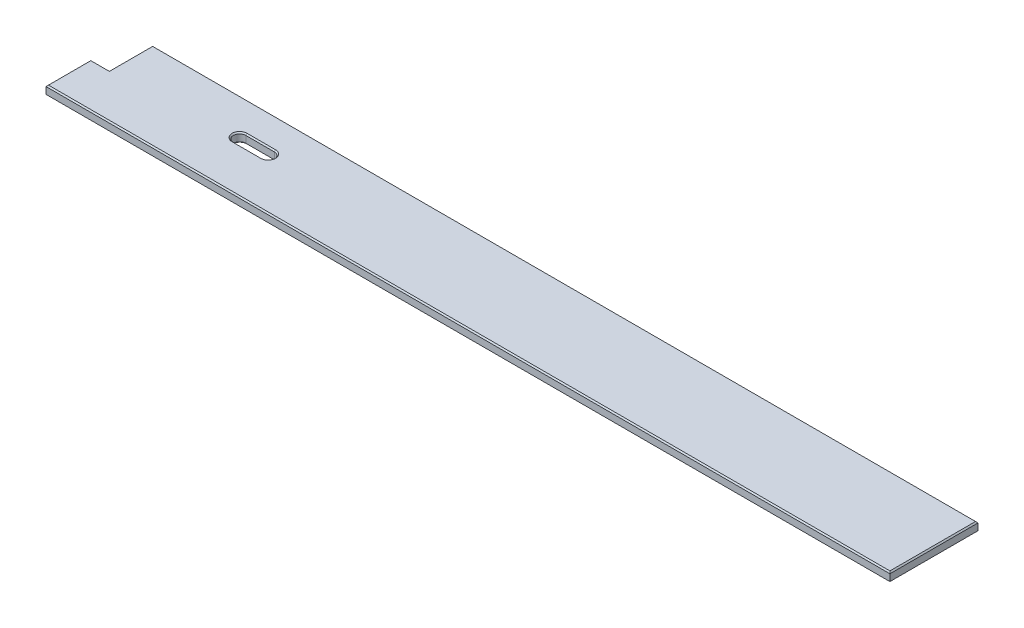
ISO-10303-21;
HEADER;
FILE_DESCRIPTION(('STEP AP214'),'2;1');
FILE_NAME('part.step','',(''),(''),'','','');
FILE_SCHEMA(('AUTOMOTIVE_DESIGN { 1 0 10303 214 1 1 1 1 }'));
ENDSEC;
DATA;
#1=APPLICATION_CONTEXT('core data for automotive mechanical design processes');
#2=APPLICATION_PROTOCOL_DEFINITION('international standard','automotive_design',2000,#1);
#3=PRODUCT_CONTEXT('',#1,'mechanical');
#4=PRODUCT('Part','Part','',(#3));
#5=PRODUCT_RELATED_PRODUCT_CATEGORY('part','',(#4));
#6=PRODUCT_DEFINITION_FORMATION('','',#4);
#7=PRODUCT_DEFINITION_CONTEXT('part definition',#1,'design');
#8=PRODUCT_DEFINITION('design','',#6,#7);
#9=PRODUCT_DEFINITION_SHAPE('','',#8);
#10=(LENGTH_UNIT() NAMED_UNIT(*) SI_UNIT(.MILLI.,.METRE.));
#11=(NAMED_UNIT(*) PLANE_ANGLE_UNIT() SI_UNIT($,.RADIAN.));
#12=(NAMED_UNIT(*) SI_UNIT($,.STERADIAN.) SOLID_ANGLE_UNIT());
#13=UNCERTAINTY_MEASURE_WITH_UNIT(LENGTH_MEASURE(1.E-05),#10,'distance_accuracy_value','');
#14=(GEOMETRIC_REPRESENTATION_CONTEXT(3) GLOBAL_UNCERTAINTY_ASSIGNED_CONTEXT((#13)) GLOBAL_UNIT_ASSIGNED_CONTEXT((#10,
#11,#12)) REPRESENTATION_CONTEXT('',''));
#15=CARTESIAN_POINT('',(0.,0.,0.));
#16=DIRECTION('',(0.,0.,1.));
#17=DIRECTION('',(1.,0.,0.));
#18=AXIS2_PLACEMENT_3D('',#15,#16,#17);
#19=CARTESIAN_POINT('',(0.,19.05,0.));
#20=DIRECTION('',(0.,-1.,0.));
#21=DIRECTION('',(0.,0.,-1.));
#22=AXIS2_PLACEMENT_3D('',#19,#20,#21);
#23=PLANE('',#22);
#24=CARTESIAN_POINT('',(254.,19.05,-105.55605));
#25=DIRECTION('',(0.,-1.,0.));
#26=DIRECTION('',(0.,0.,-1.));
#27=AXIS2_PLACEMENT_3D('',#24,#25,#26);
#28=CIRCLE('',#27,15.240000000001);
#29=CARTESIAN_POINT('',(254.,19.05,-90.3160499999989));
#30=VERTEX_POINT('',#29);
#31=CARTESIAN_POINT('',(254.,19.05,-120.796050000001));
#32=VERTEX_POINT('',#31);
#33=EDGE_CURVE('E243',#30,#32,#28,.T.);
#34=ORIENTED_EDGE('',*,*,#33,.T.);
#35=DIRECTION('',(1.,0.,0.));
#36=VECTOR('',#35,1.);
#37=CARTESIAN_POINT('',(312.7502,19.05,-120.796050000001));
#38=LINE('',#37,#36);
#39=CARTESIAN_POINT('',(312.7502,19.05,-120.796050000001));
#40=VERTEX_POINT('',#39);
#41=EDGE_CURVE('E245',#32,#40,#38,.T.);
#42=ORIENTED_EDGE('',*,*,#41,.T.);
#43=CARTESIAN_POINT('',(312.7502,19.05,-105.55605));
#44=DIRECTION('',(0.,-1.,0.));
#45=DIRECTION('',(0.,0.,-1.));
#46=AXIS2_PLACEMENT_3D('',#43,#44,#45);
#47=CIRCLE('',#46,15.240000000001);
#48=CARTESIAN_POINT('',(312.7502,19.05,-90.3160499999989));
#49=VERTEX_POINT('',#48);
#50=EDGE_CURVE('E211',#40,#49,#47,.T.);
#51=ORIENTED_EDGE('',*,*,#50,.T.);
#52=DIRECTION('',(-1.,0.,0.));
#53=VECTOR('',#52,1.);
#54=CARTESIAN_POINT('',(254.,19.05,-90.3160499999989));
#55=LINE('',#54,#53);
#56=EDGE_CURVE('E241',#49,#30,#55,.T.);
#57=ORIENTED_EDGE('',*,*,#56,.T.);
#58=EDGE_LOOP('',(#34,#42,#51,#57));
#59=FACE_BOUND('',#58,.T.);
#60=DIRECTION('',(0.,0.,-1.));
#61=VECTOR('',#60,1.);
#62=CARTESIAN_POINT('',(1692.91,19.05,0.));
#63=LINE('',#62,#61);
#64=CARTESIAN_POINT('',(1692.91,19.05,-2.53999999999999));
#65=VERTEX_POINT('',#64);
#66=CARTESIAN_POINT('',(1692.91,19.05,-178.435));
#67=VERTEX_POINT('',#66);
#68=EDGE_CURVE('E235',#65,#67,#63,.T.);
#69=ORIENTED_EDGE('',*,*,#68,.T.);
#70=DIRECTION('',(-1.,0.,0.));
#71=VECTOR('',#70,1.);
#72=CARTESIAN_POINT('',(0.,19.05,-178.435));
#73=LINE('',#72,#71);
#74=CARTESIAN_POINT('',(2.53999999999999,19.05,-178.435));
#75=VERTEX_POINT('',#74);
#76=EDGE_CURVE('E237',#67,#75,#73,.T.);
#77=ORIENTED_EDGE('',*,*,#76,.T.);
#78=DIRECTION('',(0.,0.,1.));
#79=VECTOR('',#78,1.);
#80=CARTESIAN_POINT('',(2.53999999999999,19.05,0.));
#81=LINE('',#80,#79);
#82=CARTESIAN_POINT('',(2.53999999999999,19.05,-89.535));
#83=VERTEX_POINT('',#82);
#84=EDGE_CURVE('E221',#75,#83,#81,.T.);
#85=ORIENTED_EDGE('',*,*,#84,.T.);
#86=DIRECTION('',(-1.,0.,0.));
#87=VECTOR('',#86,1.);
#88=CARTESIAN_POINT('',(-38.1,19.05,-89.535));
#89=LINE('',#88,#87);
#90=CARTESIAN_POINT('',(-35.56,19.05,-89.535));
#91=VERTEX_POINT('',#90);
#92=EDGE_CURVE('E224',#83,#91,#89,.T.);
#93=ORIENTED_EDGE('',*,*,#92,.T.);
#94=DIRECTION('',(0.,0.,1.));
#95=VECTOR('',#94,1.);
#96=CARTESIAN_POINT('',(-35.56,19.05,0.));
#97=LINE('',#96,#95);
#98=CARTESIAN_POINT('',(-35.56,19.05,-2.53999999999999));
#99=VERTEX_POINT('',#98);
#100=EDGE_CURVE('E231',#91,#99,#97,.T.);
#101=ORIENTED_EDGE('',*,*,#100,.T.);
#102=DIRECTION('',(1.,0.,0.));
#103=VECTOR('',#102,1.);
#104=CARTESIAN_POINT('',(0.,19.05,-2.53999999999999));
#105=LINE('',#104,#103);
#106=EDGE_CURVE('E233',#99,#65,#105,.T.);
#107=ORIENTED_EDGE('',*,*,#106,.T.);
#108=EDGE_LOOP('',(#69,#77,#85,#93,#101,#107));
#109=FACE_BOUND('',#108,.T.);
#110=ADVANCED_FACE('F40',(#59,#109),#23,.F.);
#111=CARTESIAN_POINT('',(0.,0.,0.));
#112=DIRECTION('',(0.,-1.,0.));
#113=DIRECTION('',(0.,0.,-1.));
#114=AXIS2_PLACEMENT_3D('',#111,#112,#113);
#115=PLANE('',#114);
#116=DIRECTION('',(-1.,0.,0.));
#117=VECTOR('',#116,1.);
#118=CARTESIAN_POINT('',(0.,0.,-120.79605));
#119=LINE('',#118,#117);
#120=CARTESIAN_POINT('',(312.7502,0.,-120.79605));
#121=VERTEX_POINT('',#120);
#122=CARTESIAN_POINT('',(254.,0.,-120.79605));
#123=VERTEX_POINT('',#122);
#124=EDGE_CURVE('E305',#121,#123,#119,.T.);
#125=ORIENTED_EDGE('',*,*,#124,.T.);
#126=CARTESIAN_POINT('',(254.,0.,-105.55605));
#127=DIRECTION('',(0.,-1.,0.));
#128=DIRECTION('',(0.,0.,-1.));
#129=AXIS2_PLACEMENT_3D('',#126,#127,#128);
#130=CIRCLE('',#129,15.24);
#131=CARTESIAN_POINT('',(254.,0.,-90.31605));
#132=VERTEX_POINT('',#131);
#133=EDGE_CURVE('E307',#123,#132,#130,.F.);
#134=ORIENTED_EDGE('',*,*,#133,.T.);
#135=DIRECTION('',(1.,0.,0.));
#136=VECTOR('',#135,1.);
#137=CARTESIAN_POINT('',(0.,0.,-90.31605));
#138=LINE('',#137,#136);
#139=CARTESIAN_POINT('',(312.7502,0.,-90.31605));
#140=VERTEX_POINT('',#139);
#141=EDGE_CURVE('E301',#132,#140,#138,.T.);
#142=ORIENTED_EDGE('',*,*,#141,.T.);
#143=CARTESIAN_POINT('',(312.7502,0.,-105.55605));
#144=DIRECTION('',(0.,-1.,0.));
#145=DIRECTION('',(0.,0.,-1.));
#146=AXIS2_PLACEMENT_3D('',#143,#144,#145);
#147=CIRCLE('',#146,15.24);
#148=EDGE_CURVE('E303',#140,#121,#147,.F.);
#149=ORIENTED_EDGE('',*,*,#148,.T.);
#150=EDGE_LOOP('',(#125,#134,#142,#149));
#151=FACE_BOUND('',#150,.T.);
#152=DIRECTION('',(0.,0.,-1.));
#153=VECTOR('',#152,1.);
#154=CARTESIAN_POINT('',(-35.56,0.,0.));
#155=LINE('',#154,#153);
#156=CARTESIAN_POINT('',(-35.56,0.,-2.53999999999999));
#157=VERTEX_POINT('',#156);
#158=CARTESIAN_POINT('',(-35.56,0.,-89.535));
#159=VERTEX_POINT('',#158);
#160=EDGE_CURVE('E296',#157,#159,#155,.T.);
#161=ORIENTED_EDGE('',*,*,#160,.T.);
#162=DIRECTION('',(1.,0.,0.));
#163=VECTOR('',#162,1.);
#164=CARTESIAN_POINT('',(0.,0.,-89.535));
#165=LINE('',#164,#163);
#166=CARTESIAN_POINT('',(2.53999999999999,0.,-89.535));
#167=VERTEX_POINT('',#166);
#168=EDGE_CURVE('E298',#159,#167,#165,.T.);
#169=ORIENTED_EDGE('',*,*,#168,.T.);
#170=DIRECTION('',(0.,0.,-1.));
#171=VECTOR('',#170,1.);
#172=CARTESIAN_POINT('',(2.53999999999999,0.,-180.975));
#173=LINE('',#172,#171);
#174=CARTESIAN_POINT('',(2.53999999999999,0.,-178.435));
#175=VERTEX_POINT('',#174);
#176=EDGE_CURVE('E265',#167,#175,#173,.T.);
#177=ORIENTED_EDGE('',*,*,#176,.T.);
#178=DIRECTION('',(1.,0.,0.));
#179=VECTOR('',#178,1.);
#180=CARTESIAN_POINT('',(1695.45,0.,-178.435));
#181=LINE('',#180,#179);
#182=CARTESIAN_POINT('',(1692.91,0.,-178.435));
#183=VERTEX_POINT('',#182);
#184=EDGE_CURVE('E290',#175,#183,#181,.T.);
#185=ORIENTED_EDGE('',*,*,#184,.T.);
#186=DIRECTION('',(0.,0.,1.));
#187=VECTOR('',#186,1.);
#188=CARTESIAN_POINT('',(1692.91,0.,0.));
#189=LINE('',#188,#187);
#190=CARTESIAN_POINT('',(1692.91,0.,-2.53999999999999));
#191=VERTEX_POINT('',#190);
#192=EDGE_CURVE('E292',#183,#191,#189,.T.);
#193=ORIENTED_EDGE('',*,*,#192,.T.);
#194=DIRECTION('',(-1.,0.,0.));
#195=VECTOR('',#194,1.);
#196=CARTESIAN_POINT('',(-38.1,0.,-2.53999999999999));
#197=LINE('',#196,#195);
#198=EDGE_CURVE('E294',#191,#157,#197,.T.);
#199=ORIENTED_EDGE('',*,*,#198,.T.);
#200=EDGE_LOOP('',(#161,#169,#177,#185,#193,#199));
#201=FACE_BOUND('',#200,.T.);
#202=ADVANCED_FACE('F360',(#151,#201),#115,.T.);
#203=CARTESIAN_POINT('',(0.,19.05,0.));
#204=DIRECTION('',(1.,0.,0.));
#205=DIRECTION('',(0.,0.,-1.));
#206=AXIS2_PLACEMENT_3D('',#203,#204,#205);
#207=PLANE('',#206);
#208=DIRECTION('',(0.,-1.,0.));
#209=VECTOR('',#208,1.);
#210=CARTESIAN_POINT('',(0.,19.05,-180.975));
#211=LINE('',#210,#209);
#212=CARTESIAN_POINT('',(0.,16.51,-180.975));
#213=VERTEX_POINT('',#212);
#214=CARTESIAN_POINT('',(0.,2.53999999999999,-180.975));
#215=VERTEX_POINT('',#214);
#216=EDGE_CURVE('E205',#213,#215,#211,.T.);
#217=ORIENTED_EDGE('',*,*,#216,.T.);
#218=DIRECTION('',(0.,0.,1.));
#219=VECTOR('',#218,1.);
#220=CARTESIAN_POINT('',(0.,2.53999999999999,-92.075));
#221=LINE('',#220,#219);
#222=CARTESIAN_POINT('',(0.,2.53999999999999,-92.075));
#223=VERTEX_POINT('',#222);
#224=EDGE_CURVE('E11',#215,#223,#221,.T.);
#225=ORIENTED_EDGE('',*,*,#224,.T.);
#226=DIRECTION('',(0.,1.,0.));
#227=VECTOR('',#226,1.);
#228=CARTESIAN_POINT('',(0.,0.,-92.075));
#229=LINE('',#228,#227);
#230=CARTESIAN_POINT('',(0.,16.51,-92.075));
#231=VERTEX_POINT('',#230);
#232=EDGE_CURVE('E272',#223,#231,#229,.T.);
#233=ORIENTED_EDGE('',*,*,#232,.T.);
#234=DIRECTION('',(0.,0.,-1.));
#235=VECTOR('',#234,1.);
#236=CARTESIAN_POINT('',(0.,16.51,0.));
#237=LINE('',#236,#235);
#238=EDGE_CURVE('E263',#231,#213,#237,.T.);
#239=ORIENTED_EDGE('',*,*,#238,.T.);
#240=EDGE_LOOP('',(#217,#225,#233,#239));
#241=FACE_BOUND('',#240,.T.);
#242=ADVANCED_FACE('F371',(#241),#207,.F.);
#243=CARTESIAN_POINT('',(0.,19.05,0.));
#244=DIRECTION('',(0.,0.,-1.));
#245=DIRECTION('',(-1.,0.,0.));
#246=AXIS2_PLACEMENT_3D('',#243,#244,#245);
#247=PLANE('',#246);
#248=DIRECTION('',(0.,1.,0.));
#249=VECTOR('',#248,1.);
#250=CARTESIAN_POINT('',(-38.1,0.,0.));
#251=LINE('',#250,#249);
#252=CARTESIAN_POINT('',(-38.1,2.53999999999999,0.));
#253=VERTEX_POINT('',#252);
#254=CARTESIAN_POINT('',(-38.1,16.51,0.));
#255=VERTEX_POINT('',#254);
#256=EDGE_CURVE('E379',#253,#255,#251,.T.);
#257=ORIENTED_EDGE('',*,*,#256,.F.);
#258=DIRECTION('',(1.,0.,0.));
#259=VECTOR('',#258,1.);
#260=CARTESIAN_POINT('',(1695.45,2.53999999999999,0.));
#261=LINE('',#260,#259);
#262=CARTESIAN_POINT('',(1695.45,2.53999999999999,0.));
#263=VERTEX_POINT('',#262);
#264=EDGE_CURVE('E323',#253,#263,#261,.T.);
#265=ORIENTED_EDGE('',*,*,#264,.T.);
#266=DIRECTION('',(0.,-1.,0.));
#267=VECTOR('',#266,1.);
#268=CARTESIAN_POINT('',(1695.45,19.05,0.));
#269=LINE('',#268,#267);
#270=CARTESIAN_POINT('',(1695.45,16.51,0.));
#271=VERTEX_POINT('',#270);
#272=EDGE_CURVE('E222',#271,#263,#269,.T.);
#273=ORIENTED_EDGE('',*,*,#272,.F.);
#274=DIRECTION('',(-1.,0.,0.));
#275=VECTOR('',#274,1.);
#276=CARTESIAN_POINT('',(0.,16.51,0.));
#277=LINE('',#276,#275);
#278=EDGE_CURVE('E254',#271,#255,#277,.T.);
#279=ORIENTED_EDGE('',*,*,#278,.T.);
#280=EDGE_LOOP('',(#257,#265,#273,#279));
#281=FACE_BOUND('',#280,.T.);
#282=ADVANCED_FACE('F398',(#281),#247,.F.);
#283=CARTESIAN_POINT('',(1695.45,19.05,0.));
#284=DIRECTION('',(-1.,0.,0.));
#285=DIRECTION('',(0.,0.,1.));
#286=AXIS2_PLACEMENT_3D('',#283,#284,#285);
#287=PLANE('',#286);
#288=ORIENTED_EDGE('',*,*,#272,.T.);
#289=DIRECTION('',(0.,0.,-1.));
#290=VECTOR('',#289,1.);
#291=CARTESIAN_POINT('',(1695.45,2.53999999999999,-180.975));
#292=LINE('',#291,#290);
#293=CARTESIAN_POINT('',(1695.45,2.53999999999999,-180.975));
#294=VERTEX_POINT('',#293);
#295=EDGE_CURVE('E65',#263,#294,#292,.T.);
#296=ORIENTED_EDGE('',*,*,#295,.T.);
#297=DIRECTION('',(0.,-1.,0.));
#298=VECTOR('',#297,1.);
#299=CARTESIAN_POINT('',(1695.45,19.05,-180.975));
#300=LINE('',#299,#298);
#301=CARTESIAN_POINT('',(1695.45,16.51,-180.975));
#302=VERTEX_POINT('',#301);
#303=EDGE_CURVE('E226',#302,#294,#300,.T.);
#304=ORIENTED_EDGE('',*,*,#303,.F.);
#305=DIRECTION('',(0.,0.,1.));
#306=VECTOR('',#305,1.);
#307=CARTESIAN_POINT('',(1695.45,16.51,0.));
#308=LINE('',#307,#306);
#309=EDGE_CURVE('E252',#302,#271,#308,.T.);
#310=ORIENTED_EDGE('',*,*,#309,.T.);
#311=EDGE_LOOP('',(#288,#296,#304,#310));
#312=FACE_BOUND('',#311,.T.);
#313=ADVANCED_FACE('F390',(#312),#287,.F.);
#314=CARTESIAN_POINT('',(0.,19.05,-180.975));
#315=DIRECTION('',(0.,0.,1.));
#316=DIRECTION('',(1.,0.,0.));
#317=AXIS2_PLACEMENT_3D('',#314,#315,#316);
#318=PLANE('',#317);
#319=ORIENTED_EDGE('',*,*,#303,.T.);
#320=DIRECTION('',(-1.,0.,0.));
#321=VECTOR('',#320,1.);
#322=CARTESIAN_POINT('',(0.,2.53999999999999,-180.975));
#323=LINE('',#322,#321);
#324=EDGE_CURVE('E50',#294,#215,#323,.T.);
#325=ORIENTED_EDGE('',*,*,#324,.T.);
#326=ORIENTED_EDGE('',*,*,#216,.F.);
#327=DIRECTION('',(1.,0.,0.));
#328=VECTOR('',#327,1.);
#329=CARTESIAN_POINT('',(0.,16.51,-180.975));
#330=LINE('',#329,#328);
#331=EDGE_CURVE('E193',#213,#302,#330,.T.);
#332=ORIENTED_EDGE('',*,*,#331,.T.);
#333=EDGE_LOOP('',(#319,#325,#326,#332));
#334=FACE_BOUND('',#333,.T.);
#335=ADVANCED_FACE('F388',(#334),#318,.F.);
#336=CARTESIAN_POINT('',(312.7502,19.05,-105.55605));
#337=DIRECTION('',(0.,-1.,0.));
#338=DIRECTION('',(0.,0.,-1.));
#339=AXIS2_PLACEMENT_3D('',#336,#337,#338);
#340=CYLINDRICAL_SURFACE('',#339,12.7);
#341=DIRECTION('',(0.,-1.,0.));
#342=VECTOR('',#341,1.);
#343=CARTESIAN_POINT('',(312.7502,19.05,-118.25605));
#344=LINE('',#343,#342);
#345=CARTESIAN_POINT('',(312.7502,16.5099999999991,-118.25605));
#346=VERTEX_POINT('',#345);
#347=CARTESIAN_POINT('',(312.7502,2.53999999999999,-118.25605));
#348=VERTEX_POINT('',#347);
#349=EDGE_CURVE('E185',#346,#348,#344,.T.);
#350=ORIENTED_EDGE('',*,*,#349,.T.);
#351=CARTESIAN_POINT('',(312.7502,2.53999999999999,-105.55605));
#352=DIRECTION('',(0.,-1.,0.));
#353=DIRECTION('',(0.,0.,-1.));
#354=AXIS2_PLACEMENT_3D('',#351,#352,#353);
#355=CIRCLE('',#354,12.7);
#356=CARTESIAN_POINT('',(312.7502,2.53999999999999,-92.85605));
#357=VERTEX_POINT('',#356);
#358=EDGE_CURVE('E314',#348,#357,#355,.T.);
#359=ORIENTED_EDGE('',*,*,#358,.T.);
#360=DIRECTION('',(0.,-1.,0.));
#361=VECTOR('',#360,1.);
#362=CARTESIAN_POINT('',(312.7502,19.05,-92.85605));
#363=LINE('',#362,#361);
#364=CARTESIAN_POINT('',(312.7502,16.5099999999991,-92.85605));
#365=VERTEX_POINT('',#364);
#366=EDGE_CURVE('E188',#365,#357,#363,.T.);
#367=ORIENTED_EDGE('',*,*,#366,.F.);
#368=CARTESIAN_POINT('',(312.7502,16.5099999999991,-105.55605));
#369=DIRECTION('',(0.,-1.,0.));
#370=DIRECTION('',(0.,0.,-1.));
#371=AXIS2_PLACEMENT_3D('',#368,#369,#370);
#372=CIRCLE('',#371,12.7);
#373=EDGE_CURVE('E182',#365,#346,#372,.F.);
#374=ORIENTED_EDGE('',*,*,#373,.T.);
#375=EDGE_LOOP('',(#350,#359,#367,#374));
#376=FACE_BOUND('',#375,.T.);
#377=ADVANCED_FACE('F184',(#376),#340,.F.);
#378=CARTESIAN_POINT('',(254.,19.05,-118.25605));
#379=DIRECTION('',(0.,0.,1.));
#380=DIRECTION('',(1.,0.,0.));
#381=AXIS2_PLACEMENT_3D('',#378,#379,#380);
#382=PLANE('',#381);
#383=DIRECTION('',(0.,-1.,0.));
#384=VECTOR('',#383,1.);
#385=CARTESIAN_POINT('',(254.,19.05,-118.25605));
#386=LINE('',#385,#384);
#387=CARTESIAN_POINT('',(254.,16.5099999999991,-118.25605));
#388=VERTEX_POINT('',#387);
#389=CARTESIAN_POINT('',(254.,2.53999999999999,-118.25605));
#390=VERTEX_POINT('',#389);
#391=EDGE_CURVE('E206',#388,#390,#386,.T.);
#392=ORIENTED_EDGE('',*,*,#391,.T.);
#393=DIRECTION('',(1.,0.,0.));
#394=VECTOR('',#393,1.);
#395=CARTESIAN_POINT('',(254.,2.53999999999999,-118.25605));
#396=LINE('',#395,#394);
#397=EDGE_CURVE('E204',#390,#348,#396,.T.);
#398=ORIENTED_EDGE('',*,*,#397,.T.);
#399=ORIENTED_EDGE('',*,*,#349,.F.);
#400=DIRECTION('',(-1.,0.,0.));
#401=VECTOR('',#400,1.);
#402=CARTESIAN_POINT('',(254.,16.5099999999991,-118.25605));
#403=LINE('',#402,#401);
#404=EDGE_CURVE('E201',#346,#388,#403,.T.);
#405=ORIENTED_EDGE('',*,*,#404,.T.);
#406=EDGE_LOOP('',(#392,#398,#399,#405));
#407=FACE_BOUND('',#406,.T.);
#408=ADVANCED_FACE('F199',(#407),#382,.T.);
#409=CARTESIAN_POINT('',(254.,19.05,-105.55605));
#410=DIRECTION('',(0.,-1.,0.));
#411=DIRECTION('',(0.,0.,-1.));
#412=AXIS2_PLACEMENT_3D('',#409,#410,#411);
#413=CYLINDRICAL_SURFACE('',#412,12.7);
#414=DIRECTION('',(0.,-1.,0.));
#415=VECTOR('',#414,1.);
#416=CARTESIAN_POINT('',(254.,19.05,-92.85605));
#417=LINE('',#416,#415);
#418=CARTESIAN_POINT('',(254.,16.5099999999991,-92.85605));
#419=VERTEX_POINT('',#418);
#420=CARTESIAN_POINT('',(254.,2.53999999999999,-92.85605));
#421=VERTEX_POINT('',#420);
#422=EDGE_CURVE('E384',#419,#421,#417,.T.);
#423=ORIENTED_EDGE('',*,*,#422,.T.);
#424=CARTESIAN_POINT('',(254.,2.53999999999999,-105.55605));
#425=DIRECTION('',(0.,-1.,0.));
#426=DIRECTION('',(0.,0.,-1.));
#427=AXIS2_PLACEMENT_3D('',#424,#425,#426);
#428=CIRCLE('',#427,12.7);
#429=EDGE_CURVE('E310',#421,#390,#428,.T.);
#430=ORIENTED_EDGE('',*,*,#429,.T.);
#431=ORIENTED_EDGE('',*,*,#391,.F.);
#432=CARTESIAN_POINT('',(254.,16.5099999999991,-105.55605));
#433=DIRECTION('',(0.,-1.,0.));
#434=DIRECTION('',(0.,0.,-1.));
#435=AXIS2_PLACEMENT_3D('',#432,#433,#434);
#436=CIRCLE('',#435,12.7);
#437=EDGE_CURVE('E247',#388,#419,#436,.F.);
#438=ORIENTED_EDGE('',*,*,#437,.T.);
#439=EDGE_LOOP('',(#423,#430,#431,#438));
#440=FACE_BOUND('',#439,.T.);
#441=ADVANCED_FACE('F552',(#440),#413,.F.);
#442=CARTESIAN_POINT('',(254.,19.05,-92.85605));
#443=DIRECTION('',(0.,0.,-1.));
#444=DIRECTION('',(-1.,0.,0.));
#445=AXIS2_PLACEMENT_3D('',#442,#443,#444);
#446=PLANE('',#445);
#447=ORIENTED_EDGE('',*,*,#366,.T.);
#448=DIRECTION('',(-1.,0.,0.));
#449=VECTOR('',#448,1.);
#450=CARTESIAN_POINT('',(254.,2.53999999999999,-92.85605));
#451=LINE('',#450,#449);
#452=EDGE_CURVE('E316',#357,#421,#451,.T.);
#453=ORIENTED_EDGE('',*,*,#452,.T.);
#454=ORIENTED_EDGE('',*,*,#422,.F.);
#455=DIRECTION('',(1.,0.,0.));
#456=VECTOR('',#455,1.);
#457=CARTESIAN_POINT('',(312.7502,16.5099999999991,-92.85605));
#458=LINE('',#457,#456);
#459=EDGE_CURVE('E194',#419,#365,#458,.T.);
#460=ORIENTED_EDGE('',*,*,#459,.T.);
#461=EDGE_LOOP('',(#447,#453,#454,#460));
#462=FACE_BOUND('',#461,.T.);
#463=ADVANCED_FACE('F548',(#462),#446,.T.);
#464=CARTESIAN_POINT('',(-38.1,0.,0.));
#465=DIRECTION('',(-1.,0.,0.));
#466=DIRECTION('',(0.,0.,1.));
#467=AXIS2_PLACEMENT_3D('',#464,#465,#466);
#468=PLANE('',#467);
#469=DIRECTION('',(0.,1.,0.));
#470=VECTOR('',#469,1.);
#471=CARTESIAN_POINT('',(-38.1,0.,-92.075));
#472=LINE('',#471,#470);
#473=CARTESIAN_POINT('',(-38.1,2.53999999999999,-92.075));
#474=VERTEX_POINT('',#473);
#475=CARTESIAN_POINT('',(-38.1,16.51,-92.075));
#476=VERTEX_POINT('',#475);
#477=EDGE_CURVE('E377',#474,#476,#472,.T.);
#478=ORIENTED_EDGE('',*,*,#477,.F.);
#479=DIRECTION('',(0.,0.,1.));
#480=VECTOR('',#479,1.);
#481=CARTESIAN_POINT('',(-38.1,2.53999999999999,0.));
#482=LINE('',#481,#480);
#483=EDGE_CURVE('E321',#474,#253,#482,.T.);
#484=ORIENTED_EDGE('',*,*,#483,.T.);
#485=ORIENTED_EDGE('',*,*,#256,.T.);
#486=DIRECTION('',(0.,0.,-1.));
#487=VECTOR('',#486,1.);
#488=CARTESIAN_POINT('',(-38.1,16.51,-92.075));
#489=LINE('',#488,#487);
#490=EDGE_CURVE('E257',#255,#476,#489,.T.);
#491=ORIENTED_EDGE('',*,*,#490,.T.);
#492=EDGE_LOOP('',(#478,#484,#485,#491));
#493=FACE_BOUND('',#492,.T.);
#494=ADVANCED_FACE('F415',(#493),#468,.T.);
#495=CARTESIAN_POINT('',(0.,0.,-92.075));
#496=DIRECTION('',(0.,0.,-1.));
#497=DIRECTION('',(-1.,0.,0.));
#498=AXIS2_PLACEMENT_3D('',#495,#496,#497);
#499=PLANE('',#498);
#500=ORIENTED_EDGE('',*,*,#232,.F.);
#501=DIRECTION('',(-1.,0.,0.));
#502=VECTOR('',#501,1.);
#503=CARTESIAN_POINT('',(0.,2.53999999999999,-92.075));
#504=LINE('',#503,#502);
#505=EDGE_CURVE('E318',#223,#474,#504,.T.);
#506=ORIENTED_EDGE('',*,*,#505,.T.);
#507=ORIENTED_EDGE('',*,*,#477,.T.);
#508=DIRECTION('',(1.,0.,0.));
#509=VECTOR('',#508,1.);
#510=CARTESIAN_POINT('',(0.,16.51,-92.075));
#511=LINE('',#510,#509);
#512=EDGE_CURVE('E260',#476,#231,#511,.T.);
#513=ORIENTED_EDGE('',*,*,#512,.T.);
#514=EDGE_LOOP('',(#500,#506,#507,#513));
#515=FACE_BOUND('',#514,.T.);
#516=ADVANCED_FACE('F373',(#515),#499,.T.);
#517=CARTESIAN_POINT('',(254.,16.5099999999991,-92.85605));
#518=DIRECTION('',(0.,0.707106781186573,-0.707106781186522));
#519=DIRECTION('',(-1.,0.,0.));
#520=AXIS2_PLACEMENT_3D('',#517,#518,#519);
#521=PLANE('',#520);
#522=DIRECTION('',(0.,-0.707106781186523,-0.707106781186572));
#523=VECTOR('',#522,1.);
#524=CARTESIAN_POINT('',(254.,19.05,-90.3160499999989));
#525=LINE('',#524,#523);
#526=EDGE_CURVE('E215',#30,#419,#525,.T.);
#527=ORIENTED_EDGE('',*,*,#526,.F.);
#528=ORIENTED_EDGE('',*,*,#56,.F.);
#529=DIRECTION('',(0.,0.707106781186523,0.707106781186572));
#530=VECTOR('',#529,1.);
#531=CARTESIAN_POINT('',(312.7502,16.5099999999991,-92.85605));
#532=LINE('',#531,#530);
#533=EDGE_CURVE('E270',#365,#49,#532,.T.);
#534=ORIENTED_EDGE('',*,*,#533,.F.);
#535=ORIENTED_EDGE('',*,*,#459,.F.);
#536=EDGE_LOOP('',(#527,#528,#534,#535));
#537=FACE_BOUND('',#536,.T.);
#538=ADVANCED_FACE('F471',(#537),#521,.T.);
#539=CARTESIAN_POINT('',(312.7502,16.5099999999991,-105.55605));
#540=DIRECTION('',(0.,1.,0.));
#541=DIRECTION('',(0.,0.,1.));
#542=AXIS2_PLACEMENT_3D('',#539,#540,#541);
#543=CONICAL_SURFACE('',#542,12.7,0.785398163397483);
#544=ORIENTED_EDGE('',*,*,#533,.T.);
#545=ORIENTED_EDGE('',*,*,#50,.F.);
#546=DIRECTION('',(0.,0.707106781186523,-0.707106781186572));
#547=VECTOR('',#546,1.);
#548=CARTESIAN_POINT('',(312.7502,16.5099999999991,-118.25605));
#549=LINE('',#548,#547);
#550=EDGE_CURVE('E209',#346,#40,#549,.T.);
#551=ORIENTED_EDGE('',*,*,#550,.F.);
#552=ORIENTED_EDGE('',*,*,#373,.F.);
#553=EDGE_LOOP('',(#544,#545,#551,#552));
#554=FACE_BOUND('',#553,.T.);
#555=ADVANCED_FACE('F210',(#554),#543,.F.);
#556=CARTESIAN_POINT('',(254.,16.5099999999991,-105.55605));
#557=DIRECTION('',(0.,1.,0.));
#558=DIRECTION('',(0.,0.,1.));
#559=AXIS2_PLACEMENT_3D('',#556,#557,#558);
#560=CONICAL_SURFACE('',#559,12.7,0.785398163397483);
#561=ORIENTED_EDGE('',*,*,#526,.T.);
#562=ORIENTED_EDGE('',*,*,#437,.F.);
#563=DIRECTION('',(0.,-0.707106781186523,0.707106781186572));
#564=VECTOR('',#563,1.);
#565=CARTESIAN_POINT('',(254.,19.05,-120.796050000001));
#566=LINE('',#565,#564);
#567=EDGE_CURVE('E216',#32,#388,#566,.T.);
#568=ORIENTED_EDGE('',*,*,#567,.F.);
#569=ORIENTED_EDGE('',*,*,#33,.F.);
#570=EDGE_LOOP('',(#561,#562,#568,#569));
#571=FACE_BOUND('',#570,.T.);
#572=ADVANCED_FACE('F459',(#571),#560,.F.);
#573=CARTESIAN_POINT('',(254.,16.5099999999991,-118.25605));
#574=DIRECTION('',(0.,0.707106781186572,0.707106781186523));
#575=DIRECTION('',(1.,0.,0.));
#576=AXIS2_PLACEMENT_3D('',#573,#574,#575);
#577=PLANE('',#576);
#578=ORIENTED_EDGE('',*,*,#550,.T.);
#579=ORIENTED_EDGE('',*,*,#41,.F.);
#580=ORIENTED_EDGE('',*,*,#567,.T.);
#581=ORIENTED_EDGE('',*,*,#404,.F.);
#582=EDGE_LOOP('',(#578,#579,#580,#581));
#583=FACE_BOUND('',#582,.T.);
#584=ADVANCED_FACE('F218',(#583),#577,.T.);
#585=CARTESIAN_POINT('',(-35.56,19.05,0.));
#586=DIRECTION('',(-0.707106781186548,0.707106781186548,0.));
#587=DIRECTION('',(0.,0.,-1.));
#588=AXIS2_PLACEMENT_3D('',#585,#586,#587);
#589=PLANE('',#588);
#590=DIRECTION('',(0.577350269189626,0.577350269189626,0.577350269189626));
#591=VECTOR('',#590,1.);
#592=CARTESIAN_POINT('',(-23.7066666666667,30.9033333333333,-77.6816666666667));
#593=LINE('',#592,#591);
#594=EDGE_CURVE('E284',#476,#91,#593,.T.);
#595=ORIENTED_EDGE('',*,*,#594,.F.);
#596=ORIENTED_EDGE('',*,*,#490,.F.);
#597=DIRECTION('',(-0.577350269189626,-0.577350269189626,0.577350269189626));
#598=VECTOR('',#597,1.);
#599=CARTESIAN_POINT('',(-36.4066666666667,18.2033333333333,-1.69333333333332));
#600=LINE('',#599,#598);
#601=EDGE_CURVE('E266',#99,#255,#600,.T.);
#602=ORIENTED_EDGE('',*,*,#601,.F.);
#603=ORIENTED_EDGE('',*,*,#100,.F.);
#604=EDGE_LOOP('',(#595,#596,#602,#603));
#605=FACE_BOUND('',#604,.T.);
#606=ADVANCED_FACE('F413',(#605),#589,.T.);
#607=CARTESIAN_POINT('',(0.,19.05,-2.53999999999999));
#608=DIRECTION('',(0.,-0.707106781186547,-0.707106781186548));
#609=DIRECTION('',(1.,0.,0.));
#610=AXIS2_PLACEMENT_3D('',#607,#608,#609);
#611=PLANE('',#610);
#612=ORIENTED_EDGE('',*,*,#601,.T.);
#613=ORIENTED_EDGE('',*,*,#278,.F.);
#614=DIRECTION('',(-0.577350269189626,0.577350269189626,-0.577350269189626));
#615=VECTOR('',#614,1.);
#616=CARTESIAN_POINT('',(1128.60666666667,583.353333333334,-566.843333333333));
#617=LINE('',#616,#615);
#618=EDGE_CURVE('E281',#65,#271,#617,.F.);
#619=ORIENTED_EDGE('',*,*,#618,.F.);
#620=ORIENTED_EDGE('',*,*,#106,.F.);
#621=EDGE_LOOP('',(#612,#613,#619,#620));
#622=FACE_BOUND('',#621,.T.);
#623=ADVANCED_FACE('F402',(#622),#611,.F.);
#624=CARTESIAN_POINT('',(0.,19.05,-89.535));
#625=DIRECTION('',(0.,0.707106781186548,-0.707106781186548));
#626=DIRECTION('',(1.,0.,0.));
#627=AXIS2_PLACEMENT_3D('',#624,#625,#626);
#628=PLANE('',#627);
#629=ORIENTED_EDGE('',*,*,#594,.T.);
#630=ORIENTED_EDGE('',*,*,#92,.F.);
#631=DIRECTION('',(-0.577350269189626,-0.577350269189626,-0.577350269189626));
#632=VECTOR('',#631,1.);
#633=CARTESIAN_POINT('',(1.69333333333332,18.2033333333333,-90.3816666666667));
#634=LINE('',#633,#632);
#635=EDGE_CURVE('E278',#231,#83,#634,.F.);
#636=ORIENTED_EDGE('',*,*,#635,.F.);
#637=ORIENTED_EDGE('',*,*,#512,.F.);
#638=EDGE_LOOP('',(#629,#630,#636,#637));
#639=FACE_BOUND('',#638,.T.);
#640=ADVANCED_FACE('F498',(#639),#628,.T.);
#641=CARTESIAN_POINT('',(1692.91,19.05,0.));
#642=DIRECTION('',(-0.707106781186548,-0.707106781186548,0.));
#643=DIRECTION('',(0.,0.,-1.));
#644=AXIS2_PLACEMENT_3D('',#641,#642,#643);
#645=PLANE('',#644);
#646=ORIENTED_EDGE('',*,*,#618,.T.);
#647=ORIENTED_EDGE('',*,*,#309,.F.);
#648=DIRECTION('',(-0.577350269189626,0.577350269189626,0.577350269189626));
#649=VECTOR('',#648,1.);
#650=CARTESIAN_POINT('',(1633.43166666667,78.5283333333333,-118.956666666667));
#651=LINE('',#650,#649);
#652=EDGE_CURVE('E275',#67,#302,#651,.F.);
#653=ORIENTED_EDGE('',*,*,#652,.F.);
#654=ORIENTED_EDGE('',*,*,#68,.F.);
#655=EDGE_LOOP('',(#646,#647,#653,#654));
#656=FACE_BOUND('',#655,.T.);
#657=ADVANCED_FACE('F406',(#656),#645,.F.);
#658=CARTESIAN_POINT('',(2.53999999999999,19.05,0.));
#659=DIRECTION('',(0.707106781186548,-0.707106781186547,0.));
#660=DIRECTION('',(0.,0.,1.));
#661=AXIS2_PLACEMENT_3D('',#658,#659,#660);
#662=PLANE('',#661);
#663=ORIENTED_EDGE('',*,*,#635,.T.);
#664=ORIENTED_EDGE('',*,*,#84,.F.);
#665=DIRECTION('',(-0.577350269189626,-0.577350269189626,-0.577350269189626));
#666=VECTOR('',#665,1.);
#667=CARTESIAN_POINT('',(62.0183333333333,78.5283333333334,-118.956666666667));
#668=LINE('',#667,#666);
#669=EDGE_CURVE('E273',#213,#75,#668,.F.);
#670=ORIENTED_EDGE('',*,*,#669,.F.);
#671=ORIENTED_EDGE('',*,*,#238,.F.);
#672=EDGE_LOOP('',(#663,#664,#670,#671));
#673=FACE_BOUND('',#672,.T.);
#674=ADVANCED_FACE('F485',(#673),#662,.F.);
#675=CARTESIAN_POINT('',(0.,19.05,-178.435));
#676=DIRECTION('',(0.,-0.707106781186548,0.707106781186548));
#677=DIRECTION('',(-1.,0.,0.));
#678=AXIS2_PLACEMENT_3D('',#675,#676,#677);
#679=PLANE('',#678);
#680=ORIENTED_EDGE('',*,*,#652,.T.);
#681=ORIENTED_EDGE('',*,*,#331,.F.);
#682=ORIENTED_EDGE('',*,*,#669,.T.);
#683=ORIENTED_EDGE('',*,*,#76,.F.);
#684=EDGE_LOOP('',(#680,#681,#682,#683));
#685=FACE_BOUND('',#684,.T.);
#686=ADVANCED_FACE('F477',(#685),#679,.F.);
#687=CARTESIAN_POINT('',(312.7502,0.,-105.55605));
#688=DIRECTION('',(0.,-1.,0.));
#689=DIRECTION('',(0.,0.,-1.));
#690=AXIS2_PLACEMENT_3D('',#687,#688,#689);
#691=CONICAL_SURFACE('',#690,15.24,0.785398163397448);
#692=DIRECTION('',(0.,-0.707106781186548,0.707106781186548));
#693=VECTOR('',#692,1.);
#694=CARTESIAN_POINT('',(312.7502,2.53999999999999,-92.85605));
#695=LINE('',#694,#693);
#696=EDGE_CURVE('E331',#357,#140,#695,.T.);
#697=ORIENTED_EDGE('',*,*,#696,.F.);
#698=ORIENTED_EDGE('',*,*,#358,.F.);
#699=DIRECTION('',(0.,0.707106781186548,0.707106781186548));
#700=VECTOR('',#699,1.);
#701=CARTESIAN_POINT('',(312.7502,0.,-120.79605));
#702=LINE('',#701,#700);
#703=EDGE_CURVE('E276',#121,#348,#702,.T.);
#704=ORIENTED_EDGE('',*,*,#703,.F.);
#705=ORIENTED_EDGE('',*,*,#148,.F.);
#706=EDGE_LOOP('',(#697,#698,#704,#705));
#707=FACE_BOUND('',#706,.T.);
#708=ADVANCED_FACE('F484',(#707),#691,.F.);
#709=CARTESIAN_POINT('',(0.,0.,-120.79605));
#710=DIRECTION('',(0.,0.707106781186547,-0.707106781186548));
#711=DIRECTION('',(-1.,0.,0.));
#712=AXIS2_PLACEMENT_3D('',#709,#710,#711);
#713=PLANE('',#712);
#714=ORIENTED_EDGE('',*,*,#703,.T.);
#715=ORIENTED_EDGE('',*,*,#397,.F.);
#716=DIRECTION('',(0.,0.707106781186548,0.707106781186548));
#717=VECTOR('',#716,1.);
#718=CARTESIAN_POINT('',(254.,0.,-120.79605));
#719=LINE('',#718,#717);
#720=EDGE_CURVE('E329',#123,#390,#719,.T.);
#721=ORIENTED_EDGE('',*,*,#720,.F.);
#722=ORIENTED_EDGE('',*,*,#124,.F.);
#723=EDGE_LOOP('',(#714,#715,#721,#722));
#724=FACE_BOUND('',#723,.T.);
#725=ADVANCED_FACE('F527',(#724),#713,.F.);
#726=CARTESIAN_POINT('',(0.,0.,-90.31605));
#727=DIRECTION('',(0.,0.707106781186548,0.707106781186547));
#728=DIRECTION('',(1.,0.,0.));
#729=AXIS2_PLACEMENT_3D('',#726,#727,#728);
#730=PLANE('',#729);
#731=ORIENTED_EDGE('',*,*,#696,.T.);
#732=ORIENTED_EDGE('',*,*,#141,.F.);
#733=DIRECTION('',(0.,-0.707106781186548,0.707106781186548));
#734=VECTOR('',#733,1.);
#735=CARTESIAN_POINT('',(254.,2.53999999999999,-92.85605));
#736=LINE('',#735,#734);
#737=EDGE_CURVE('E327',#421,#132,#736,.T.);
#738=ORIENTED_EDGE('',*,*,#737,.F.);
#739=ORIENTED_EDGE('',*,*,#452,.F.);
#740=EDGE_LOOP('',(#731,#732,#738,#739));
#741=FACE_BOUND('',#740,.T.);
#742=ADVANCED_FACE('F520',(#741),#730,.F.);
#743=CARTESIAN_POINT('',(254.,0.,-105.55605));
#744=DIRECTION('',(0.,-1.,0.));
#745=DIRECTION('',(0.,0.,-1.));
#746=AXIS2_PLACEMENT_3D('',#743,#744,#745);
#747=CONICAL_SURFACE('',#746,15.24,0.785398163397448);
#748=ORIENTED_EDGE('',*,*,#720,.T.);
#749=ORIENTED_EDGE('',*,*,#429,.F.);
#750=ORIENTED_EDGE('',*,*,#737,.T.);
#751=ORIENTED_EDGE('',*,*,#133,.F.);
#752=EDGE_LOOP('',(#748,#749,#750,#751));
#753=FACE_BOUND('',#752,.T.);
#754=ADVANCED_FACE('F514',(#753),#747,.F.);
#755=CARTESIAN_POINT('',(1695.45,2.53999999999999,0.));
#756=DIRECTION('',(0.707106781186548,-0.707106781186548,0.));
#757=DIRECTION('',(0.,0.,1.));
#758=AXIS2_PLACEMENT_3D('',#755,#756,#757);
#759=PLANE('',#758);
#760=DIRECTION('',(-0.577350269189626,-0.577350269189626,-0.577350269189626));
#761=VECTOR('',#760,1.);
#762=CARTESIAN_POINT('',(1695.45,2.53999999999999,0.));
#763=LINE('',#762,#761);
#764=EDGE_CURVE('E345',#191,#263,#763,.F.);
#765=ORIENTED_EDGE('',*,*,#764,.F.);
#766=ORIENTED_EDGE('',*,*,#192,.F.);
#767=DIRECTION('',(-0.577350269189626,-0.577350269189626,0.577350269189626));
#768=VECTOR('',#767,1.);
#769=CARTESIAN_POINT('',(1130.3,-562.61,384.175));
#770=LINE('',#769,#768);
#771=EDGE_CURVE('E45',#294,#183,#770,.T.);
#772=ORIENTED_EDGE('',*,*,#771,.F.);
#773=ORIENTED_EDGE('',*,*,#295,.F.);
#774=EDGE_LOOP('',(#765,#766,#772,#773));
#775=FACE_BOUND('',#774,.T.);
#776=ADVANCED_FACE('F43',(#775),#759,.T.);
#777=CARTESIAN_POINT('',(0.,2.53999999999999,-180.975));
#778=DIRECTION('',(0.,-0.707106781186548,-0.707106781186548));
#779=DIRECTION('',(1.,0.,0.));
#780=AXIS2_PLACEMENT_3D('',#777,#778,#779);
#781=PLANE('',#780);
#782=ORIENTED_EDGE('',*,*,#771,.T.);
#783=ORIENTED_EDGE('',*,*,#184,.F.);
#784=DIRECTION('',(0.577350269189626,-0.577350269189626,0.577350269189626));
#785=VECTOR('',#784,1.);
#786=CARTESIAN_POINT('',(60.325,-57.785,-120.65));
#787=LINE('',#786,#785);
#788=EDGE_CURVE('E343',#215,#175,#787,.T.);
#789=ORIENTED_EDGE('',*,*,#788,.F.);
#790=ORIENTED_EDGE('',*,*,#324,.F.);
#791=EDGE_LOOP('',(#782,#783,#789,#790));
#792=FACE_BOUND('',#791,.T.);
#793=ADVANCED_FACE('F355',(#792),#781,.T.);
#794=CARTESIAN_POINT('',(0.,2.53999999999999,0.));
#795=DIRECTION('',(0.,-0.707106781186547,0.707106781186548));
#796=DIRECTION('',(-1.,0.,0.));
#797=AXIS2_PLACEMENT_3D('',#794,#795,#796);
#798=PLANE('',#797);
#799=ORIENTED_EDGE('',*,*,#764,.T.);
#800=ORIENTED_EDGE('',*,*,#264,.F.);
#801=DIRECTION('',(-0.577350269189626,0.577350269189626,0.577350269189626));
#802=VECTOR('',#801,1.);
#803=CARTESIAN_POINT('',(-25.4,-10.16,-12.7));
#804=LINE('',#803,#802);
#805=EDGE_CURVE('E340',#157,#253,#804,.T.);
#806=ORIENTED_EDGE('',*,*,#805,.F.);
#807=ORIENTED_EDGE('',*,*,#198,.F.);
#808=EDGE_LOOP('',(#799,#800,#806,#807));
#809=FACE_BOUND('',#808,.T.);
#810=ADVANCED_FACE('F417',(#809),#798,.T.);
#811=CARTESIAN_POINT('',(0.,2.53999999999999,0.));
#812=DIRECTION('',(-0.707106781186548,-0.707106781186547,0.));
#813=DIRECTION('',(0.,0.,-1.));
#814=AXIS2_PLACEMENT_3D('',#811,#812,#813);
#815=PLANE('',#814);
#816=ORIENTED_EDGE('',*,*,#788,.T.);
#817=ORIENTED_EDGE('',*,*,#176,.F.);
#818=DIRECTION('',(0.577350269189626,-0.577350269189626,0.577350269189626));
#819=VECTOR('',#818,1.);
#820=CARTESIAN_POINT('',(0.,2.53999999999999,-92.075));
#821=LINE('',#820,#819);
#822=EDGE_CURVE('E338',#223,#167,#821,.T.);
#823=ORIENTED_EDGE('',*,*,#822,.F.);
#824=ORIENTED_EDGE('',*,*,#224,.F.);
#825=EDGE_LOOP('',(#816,#817,#823,#824));
#826=FACE_BOUND('',#825,.T.);
#827=ADVANCED_FACE('F366',(#826),#815,.T.);
#828=CARTESIAN_POINT('',(-38.1,2.53999999999999,0.));
#829=DIRECTION('',(0.707106781186548,0.707106781186548,0.));
#830=DIRECTION('',(0.,0.,1.));
#831=AXIS2_PLACEMENT_3D('',#828,#829,#830);
#832=PLANE('',#831);
#833=ORIENTED_EDGE('',*,*,#805,.T.);
#834=ORIENTED_EDGE('',*,*,#483,.F.);
#835=DIRECTION('',(0.577350269189626,-0.577350269189626,0.577350269189626));
#836=VECTOR('',#835,1.);
#837=CARTESIAN_POINT('',(-7.40833333333334,-28.1516666666667,-61.3833333333333));
#838=LINE('',#837,#836);
#839=EDGE_CURVE('E336',#159,#474,#838,.F.);
#840=ORIENTED_EDGE('',*,*,#839,.F.);
#841=ORIENTED_EDGE('',*,*,#160,.F.);
#842=EDGE_LOOP('',(#833,#834,#840,#841));
#843=FACE_BOUND('',#842,.T.);
#844=ADVANCED_FACE('F420',(#843),#832,.F.);
#845=CARTESIAN_POINT('',(0.,2.53999999999999,-92.075));
#846=DIRECTION('',(0.,0.707106781186548,0.707106781186548));
#847=DIRECTION('',(-1.,0.,0.));
#848=AXIS2_PLACEMENT_3D('',#845,#846,#847);
#849=PLANE('',#848);
#850=ORIENTED_EDGE('',*,*,#822,.T.);
#851=ORIENTED_EDGE('',*,*,#168,.F.);
#852=ORIENTED_EDGE('',*,*,#839,.T.);
#853=ORIENTED_EDGE('',*,*,#505,.F.);
#854=EDGE_LOOP('',(#850,#851,#852,#853));
#855=FACE_BOUND('',#854,.T.);
#856=ADVANCED_FACE('F423',(#855),#849,.F.);
#857=CLOSED_SHELL('',(#110,#202,#242,#282,#313,#335,#377,#408,#441,#463,#494,#516,#538,#555,
#572,#584,#606,#623,#640,#657,#674,#686,#708,#725,#742,#754,#776,#793,#810,#827,#844,#856));
#858=MANIFOLD_SOLID_BREP('B2',#857);
#859=ADVANCED_BREP_SHAPE_REPRESENTATION('',(#18,#858),#14);
#860=SHAPE_DEFINITION_REPRESENTATION(#9,#859);
ENDSEC;
END-ISO-10303-21;
